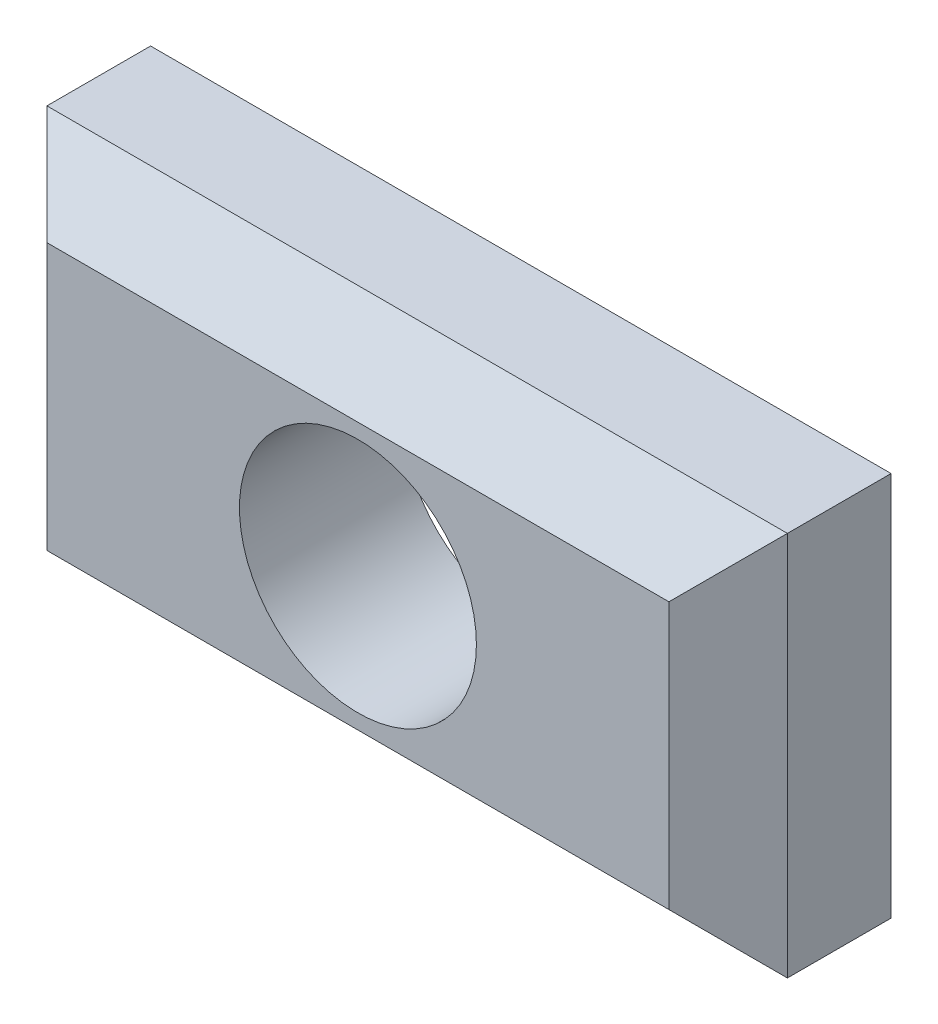
ISO-10303-21;
HEADER;
FILE_DESCRIPTION(('STEP AP214'),'2;1');
FILE_NAME('part.step','',(''),(''),'','','');
FILE_SCHEMA(('AUTOMOTIVE_DESIGN { 1 0 10303 214 1 1 1 1 }'));
ENDSEC;
DATA;
#1=APPLICATION_CONTEXT('core data for automotive mechanical design processes');
#2=APPLICATION_PROTOCOL_DEFINITION('international standard','automotive_design',2000,#1);
#3=PRODUCT_CONTEXT('',#1,'mechanical');
#4=PRODUCT('Part','Part','',(#3));
#5=PRODUCT_RELATED_PRODUCT_CATEGORY('part','',(#4));
#6=PRODUCT_DEFINITION_FORMATION('','',#4);
#7=PRODUCT_DEFINITION_CONTEXT('part definition',#1,'design');
#8=PRODUCT_DEFINITION('design','',#6,#7);
#9=PRODUCT_DEFINITION_SHAPE('','',#8);
#10=(LENGTH_UNIT() NAMED_UNIT(*) SI_UNIT(.MILLI.,.METRE.));
#11=(NAMED_UNIT(*) PLANE_ANGLE_UNIT() SI_UNIT($,.RADIAN.));
#12=(NAMED_UNIT(*) SI_UNIT($,.STERADIAN.) SOLID_ANGLE_UNIT());
#13=UNCERTAINTY_MEASURE_WITH_UNIT(LENGTH_MEASURE(1.E-05),#10,'distance_accuracy_value','');
#14=(GEOMETRIC_REPRESENTATION_CONTEXT(3) GLOBAL_UNCERTAINTY_ASSIGNED_CONTEXT((#13)) GLOBAL_UNIT_ASSIGNED_CONTEXT((#10,
#11,#12)) REPRESENTATION_CONTEXT('',''));
#15=CARTESIAN_POINT('',(0.,0.,0.));
#16=DIRECTION('',(0.,0.,1.));
#17=DIRECTION('',(1.,0.,0.));
#18=AXIS2_PLACEMENT_3D('',#15,#16,#17);
#19=CARTESIAN_POINT('',(-11.5,-3.25,4.5));
#20=DIRECTION('',(-0.707106781186547,0.,0.707106781186548));
#21=DIRECTION('',(0.707106781186548,0.,0.707106781186547));
#22=AXIS2_PLACEMENT_3D('',#19,#20,#21);
#23=PLANE('',#22);
#24=DIRECTION('',(0.,1.,0.));
#25=VECTOR('',#24,1.);
#26=CARTESIAN_POINT('',(-12.5,-6.5,3.5));
#27=LINE('',#26,#25);
#28=CARTESIAN_POINT('',(-12.5,-6.5,3.5));
#29=VERTEX_POINT('',#28);
#30=CARTESIAN_POINT('',(-12.5,6.5,3.5));
#31=VERTEX_POINT('',#30);
#32=EDGE_CURVE('E81',#29,#31,#27,.T.);
#33=ORIENTED_EDGE('',*,*,#32,.F.);
#34=DIRECTION('',(-0.577350269189626,-0.577350269189626,-0.577350269189625));
#35=VECTOR('',#34,1.);
#36=CARTESIAN_POINT('',(-10.5,-4.5,5.5));
#37=LINE('',#36,#35);
#38=CARTESIAN_POINT('',(-10.5,-4.5,5.5));
#39=VERTEX_POINT('',#38);
#40=EDGE_CURVE('E80',#39,#29,#37,.T.);
#41=ORIENTED_EDGE('',*,*,#40,.F.);
#42=DIRECTION('',(0.,1.,0.));
#43=VECTOR('',#42,1.);
#44=CARTESIAN_POINT('',(-10.5,0.,5.5));
#45=LINE('',#44,#43);
#46=CARTESIAN_POINT('',(-10.5,4.5,5.5));
#47=VERTEX_POINT('',#46);
#48=EDGE_CURVE('E70',#47,#39,#45,.F.);
#49=ORIENTED_EDGE('',*,*,#48,.F.);
#50=DIRECTION('',(0.577350269189627,-0.577350269189626,0.577350269189626));
#51=VECTOR('',#50,1.);
#52=CARTESIAN_POINT('',(-12.5,6.5,3.5));
#53=LINE('',#52,#51);
#54=EDGE_CURVE('E65',#31,#47,#53,.T.);
#55=ORIENTED_EDGE('',*,*,#54,.F.);
#56=EDGE_LOOP('',(#33,#41,#49,#55));
#57=FACE_BOUND('',#56,.T.);
#58=ADVANCED_FACE('F14',(#57),#23,.T.);
#59=CARTESIAN_POINT('',(6.25,-5.5,4.5));
#60=DIRECTION('',(0.,-0.707106781186547,0.707106781186548));
#61=DIRECTION('',(0.,-0.707106781186548,-0.707106781186547));
#62=AXIS2_PLACEMENT_3D('',#59,#60,#61);
#63=PLANE('',#62);
#64=DIRECTION('',(1.,0.,0.));
#65=VECTOR('',#64,1.);
#66=CARTESIAN_POINT('',(12.5,-6.5,3.5));
#67=LINE('',#66,#65);
#68=CARTESIAN_POINT('',(12.5,-6.5,3.5));
#69=VERTEX_POINT('',#68);
#70=EDGE_CURVE('E112',#69,#29,#67,.F.);
#71=ORIENTED_EDGE('',*,*,#70,.F.);
#72=DIRECTION('',(0.577350269189626,-0.577350269189626,-0.577350269189626));
#73=VECTOR('',#72,1.);
#74=CARTESIAN_POINT('',(10.5,-4.5,5.5));
#75=LINE('',#74,#73);
#76=CARTESIAN_POINT('',(10.5,-4.5,5.5));
#77=VERTEX_POINT('',#76);
#78=EDGE_CURVE('E86',#77,#69,#75,.T.);
#79=ORIENTED_EDGE('',*,*,#78,.F.);
#80=DIRECTION('',(1.,0.,0.));
#81=VECTOR('',#80,1.);
#82=CARTESIAN_POINT('',(0.,-4.5,5.5));
#83=LINE('',#82,#81);
#84=EDGE_CURVE('E74',#39,#77,#83,.T.);
#85=ORIENTED_EDGE('',*,*,#84,.F.);
#86=ORIENTED_EDGE('',*,*,#40,.T.);
#87=EDGE_LOOP('',(#71,#79,#85,#86));
#88=FACE_BOUND('',#87,.T.);
#89=ADVANCED_FACE('F88',(#88),#63,.T.);
#90=CARTESIAN_POINT('',(11.5,3.25,4.5));
#91=DIRECTION('',(0.707106781186548,0.,0.707106781186547));
#92=DIRECTION('',(0.707106781186547,0.,-0.707106781186548));
#93=AXIS2_PLACEMENT_3D('',#90,#91,#92);
#94=PLANE('',#93);
#95=DIRECTION('',(0.,1.,0.));
#96=VECTOR('',#95,1.);
#97=CARTESIAN_POINT('',(12.5,6.5,3.5));
#98=LINE('',#97,#96);
#99=CARTESIAN_POINT('',(12.5,6.5,3.5));
#100=VERTEX_POINT('',#99);
#101=EDGE_CURVE('E103',#100,#69,#98,.F.);
#102=ORIENTED_EDGE('',*,*,#101,.F.);
#103=DIRECTION('',(0.577350269189625,0.577350269189626,-0.577350269189626));
#104=VECTOR('',#103,1.);
#105=CARTESIAN_POINT('',(10.5,4.5,5.5));
#106=LINE('',#105,#104);
#107=CARTESIAN_POINT('',(10.5,4.5,5.5));
#108=VERTEX_POINT('',#107);
#109=EDGE_CURVE('E96',#108,#100,#106,.T.);
#110=ORIENTED_EDGE('',*,*,#109,.F.);
#111=DIRECTION('',(0.,1.,0.));
#112=VECTOR('',#111,1.);
#113=CARTESIAN_POINT('',(10.5,0.,5.5));
#114=LINE('',#113,#112);
#115=EDGE_CURVE('E90',#77,#108,#114,.T.);
#116=ORIENTED_EDGE('',*,*,#115,.F.);
#117=ORIENTED_EDGE('',*,*,#78,.T.);
#118=EDGE_LOOP('',(#102,#110,#116,#117));
#119=FACE_BOUND('',#118,.T.);
#120=ADVANCED_FACE('F101',(#119),#94,.T.);
#121=CARTESIAN_POINT('',(-6.25,5.5,4.5));
#122=DIRECTION('',(0.,0.707106781186548,0.707106781186548));
#123=DIRECTION('',(0.,-0.707106781186548,0.707106781186548));
#124=AXIS2_PLACEMENT_3D('',#121,#122,#123);
#125=PLANE('',#124);
#126=DIRECTION('',(1.,0.,0.));
#127=VECTOR('',#126,1.);
#128=CARTESIAN_POINT('',(-12.5,6.5,3.5));
#129=LINE('',#128,#127);
#130=EDGE_CURVE('E119',#31,#100,#129,.T.);
#131=ORIENTED_EDGE('',*,*,#130,.F.);
#132=ORIENTED_EDGE('',*,*,#54,.T.);
#133=DIRECTION('',(1.,0.,0.));
#134=VECTOR('',#133,1.);
#135=CARTESIAN_POINT('',(0.,4.5,5.5));
#136=LINE('',#135,#134);
#137=EDGE_CURVE('E76',#108,#47,#136,.F.);
#138=ORIENTED_EDGE('',*,*,#137,.F.);
#139=ORIENTED_EDGE('',*,*,#109,.T.);
#140=EDGE_LOOP('',(#131,#132,#138,#139));
#141=FACE_BOUND('',#140,.T.);
#142=ADVANCED_FACE('F133',(#141),#125,.T.);
#143=CARTESIAN_POINT('',(0.,0.,5.5));
#144=DIRECTION('',(0.,0.,1.));
#145=DIRECTION('',(1.,0.,0.));
#146=AXIS2_PLACEMENT_3D('',#143,#144,#145);
#147=PLANE('',#146);
#148=CARTESIAN_POINT('',(0.,0.,5.5));
#149=DIRECTION('',(0.,0.,1.));
#150=DIRECTION('',(1.,0.,0.));
#151=AXIS2_PLACEMENT_3D('',#148,#149,#150);
#152=CIRCLE('',#151,4.);
#153=CARTESIAN_POINT('',(4.,0.,5.5));
#154=VERTEX_POINT('',#153);
#155=EDGE_CURVE('E17',#154,#154,#152,.F.);
#156=ORIENTED_EDGE('',*,*,#155,.T.);
#157=EDGE_LOOP('',(#156));
#158=FACE_BOUND('',#157,.T.);
#159=ORIENTED_EDGE('',*,*,#115,.T.);
#160=ORIENTED_EDGE('',*,*,#137,.T.);
#161=ORIENTED_EDGE('',*,*,#48,.T.);
#162=ORIENTED_EDGE('',*,*,#84,.T.);
#163=EDGE_LOOP('',(#159,#160,#161,#162));
#164=FACE_BOUND('',#163,.T.);
#165=ADVANCED_FACE('F72',(#158,#164),#147,.T.);
#166=CARTESIAN_POINT('',(-12.5,-6.5,0.));
#167=DIRECTION('',(-1.,0.,0.));
#168=DIRECTION('',(0.,0.,1.));
#169=AXIS2_PLACEMENT_3D('',#166,#167,#168);
#170=PLANE('',#169);
#171=DIRECTION('',(0.,1.,0.));
#172=VECTOR('',#171,1.);
#173=CARTESIAN_POINT('',(-12.5,0.,0.));
#174=LINE('',#173,#172);
#175=CARTESIAN_POINT('',(-12.5,6.5,0.));
#176=VERTEX_POINT('',#175);
#177=CARTESIAN_POINT('',(-12.5,-6.5,0.));
#178=VERTEX_POINT('',#177);
#179=EDGE_CURVE('E214',#176,#178,#174,.F.);
#180=ORIENTED_EDGE('',*,*,#179,.T.);
#181=DIRECTION('',(0.,0.,-1.));
#182=VECTOR('',#181,1.);
#183=CARTESIAN_POINT('',(-12.5,-6.5,0.));
#184=LINE('',#183,#182);
#185=EDGE_CURVE('E110',#29,#178,#184,.T.);
#186=ORIENTED_EDGE('',*,*,#185,.F.);
#187=ORIENTED_EDGE('',*,*,#32,.T.);
#188=DIRECTION('',(0.,0.,1.));
#189=VECTOR('',#188,1.);
#190=CARTESIAN_POINT('',(-12.5,6.5,0.));
#191=LINE('',#190,#189);
#192=EDGE_CURVE('E130',#176,#31,#191,.T.);
#193=ORIENTED_EDGE('',*,*,#192,.F.);
#194=EDGE_LOOP('',(#180,#186,#187,#193));
#195=FACE_BOUND('',#194,.T.);
#196=ADVANCED_FACE('F128',(#195),#170,.T.);
#197=CARTESIAN_POINT('',(12.5,-6.5,0.));
#198=DIRECTION('',(0.,-1.,0.));
#199=DIRECTION('',(0.,0.,-1.));
#200=AXIS2_PLACEMENT_3D('',#197,#198,#199);
#201=PLANE('',#200);
#202=DIRECTION('',(1.,0.,0.));
#203=VECTOR('',#202,1.);
#204=CARTESIAN_POINT('',(0.,-6.5,0.));
#205=LINE('',#204,#203);
#206=CARTESIAN_POINT('',(12.5,-6.5,0.));
#207=VERTEX_POINT('',#206);
#208=EDGE_CURVE('E118',#178,#207,#205,.T.);
#209=ORIENTED_EDGE('',*,*,#208,.T.);
#210=DIRECTION('',(0.,0.,-1.));
#211=VECTOR('',#210,1.);
#212=CARTESIAN_POINT('',(12.5,-6.5,0.));
#213=LINE('',#212,#211);
#214=EDGE_CURVE('E108',#69,#207,#213,.T.);
#215=ORIENTED_EDGE('',*,*,#214,.F.);
#216=ORIENTED_EDGE('',*,*,#70,.T.);
#217=ORIENTED_EDGE('',*,*,#185,.T.);
#218=EDGE_LOOP('',(#209,#215,#216,#217));
#219=FACE_BOUND('',#218,.T.);
#220=ADVANCED_FACE('F116',(#219),#201,.T.);
#221=CARTESIAN_POINT('',(12.5,6.5,0.));
#222=DIRECTION('',(1.,0.,0.));
#223=DIRECTION('',(0.,0.,-1.));
#224=AXIS2_PLACEMENT_3D('',#221,#222,#223);
#225=PLANE('',#224);
#226=DIRECTION('',(0.,1.,0.));
#227=VECTOR('',#226,1.);
#228=CARTESIAN_POINT('',(12.5,0.,0.));
#229=LINE('',#228,#227);
#230=CARTESIAN_POINT('',(12.5,6.5,0.));
#231=VERTEX_POINT('',#230);
#232=EDGE_CURVE('E211',#207,#231,#229,.T.);
#233=ORIENTED_EDGE('',*,*,#232,.T.);
#234=DIRECTION('',(0.,0.,1.));
#235=VECTOR('',#234,1.);
#236=CARTESIAN_POINT('',(12.5,6.5,0.));
#237=LINE('',#236,#235);
#238=EDGE_CURVE('E31',#100,#231,#237,.F.);
#239=ORIENTED_EDGE('',*,*,#238,.F.);
#240=ORIENTED_EDGE('',*,*,#101,.T.);
#241=ORIENTED_EDGE('',*,*,#214,.T.);
#242=EDGE_LOOP('',(#233,#239,#240,#241));
#243=FACE_BOUND('',#242,.T.);
#244=ADVANCED_FACE('F106',(#243),#225,.T.);
#245=CARTESIAN_POINT('',(-12.5,6.5,0.));
#246=DIRECTION('',(0.,1.,0.));
#247=DIRECTION('',(0.,0.,1.));
#248=AXIS2_PLACEMENT_3D('',#245,#246,#247);
#249=PLANE('',#248);
#250=DIRECTION('',(1.,0.,0.));
#251=VECTOR('',#250,1.);
#252=CARTESIAN_POINT('',(0.,6.5,0.));
#253=LINE('',#252,#251);
#254=EDGE_CURVE('E23',#231,#176,#253,.F.);
#255=ORIENTED_EDGE('',*,*,#254,.T.);
#256=ORIENTED_EDGE('',*,*,#192,.T.);
#257=ORIENTED_EDGE('',*,*,#130,.T.);
#258=ORIENTED_EDGE('',*,*,#238,.T.);
#259=EDGE_LOOP('',(#255,#256,#257,#258));
#260=FACE_BOUND('',#259,.T.);
#261=ADVANCED_FACE('F131',(#260),#249,.T.);
#262=CARTESIAN_POINT('',(0.,0.,0.));
#263=DIRECTION('',(0.,0.,1.));
#264=DIRECTION('',(1.,0.,0.));
#265=AXIS2_PLACEMENT_3D('',#262,#263,#264);
#266=CYLINDRICAL_SURFACE('',#265,4.);
#267=CARTESIAN_POINT('',(0.,0.,0.));
#268=DIRECTION('',(0.,0.,1.));
#269=DIRECTION('',(1.,0.,0.));
#270=AXIS2_PLACEMENT_3D('',#267,#268,#269);
#271=CIRCLE('',#270,4.);
#272=CARTESIAN_POINT('',(4.,0.,0.));
#273=VERTEX_POINT('',#272);
#274=EDGE_CURVE('E9',#273,#273,#271,.F.);
#275=ORIENTED_EDGE('',*,*,#274,.T.);
#276=EDGE_LOOP('',(#275));
#277=FACE_BOUND('',#276,.T.);
#278=ORIENTED_EDGE('',*,*,#155,.F.);
#279=EDGE_LOOP('',(#278));
#280=FACE_BOUND('',#279,.T.);
#281=ADVANCED_FACE('F146',(#277,#280),#266,.F.);
#282=CARTESIAN_POINT('',(0.,0.,0.));
#283=DIRECTION('',(0.,0.,1.));
#284=DIRECTION('',(1.,0.,0.));
#285=AXIS2_PLACEMENT_3D('',#282,#283,#284);
#286=PLANE('',#285);
#287=ORIENTED_EDGE('',*,*,#274,.F.);
#288=EDGE_LOOP('',(#287));
#289=FACE_BOUND('',#288,.T.);
#290=ORIENTED_EDGE('',*,*,#232,.F.);
#291=ORIENTED_EDGE('',*,*,#208,.F.);
#292=ORIENTED_EDGE('',*,*,#179,.F.);
#293=ORIENTED_EDGE('',*,*,#254,.F.);
#294=EDGE_LOOP('',(#290,#291,#292,#293));
#295=FACE_BOUND('',#294,.T.);
#296=ADVANCED_FACE('F144',(#289,#295),#286,.F.);
#297=CLOSED_SHELL('',(#58,#89,#120,#142,#165,#196,#220,#244,#261,#281,#296));
#298=MANIFOLD_SOLID_BREP('B1',#297);
#299=ADVANCED_BREP_SHAPE_REPRESENTATION('',(#18,#298),#14);
#300=SHAPE_DEFINITION_REPRESENTATION(#9,#299);
ENDSEC;
END-ISO-10303-21;
